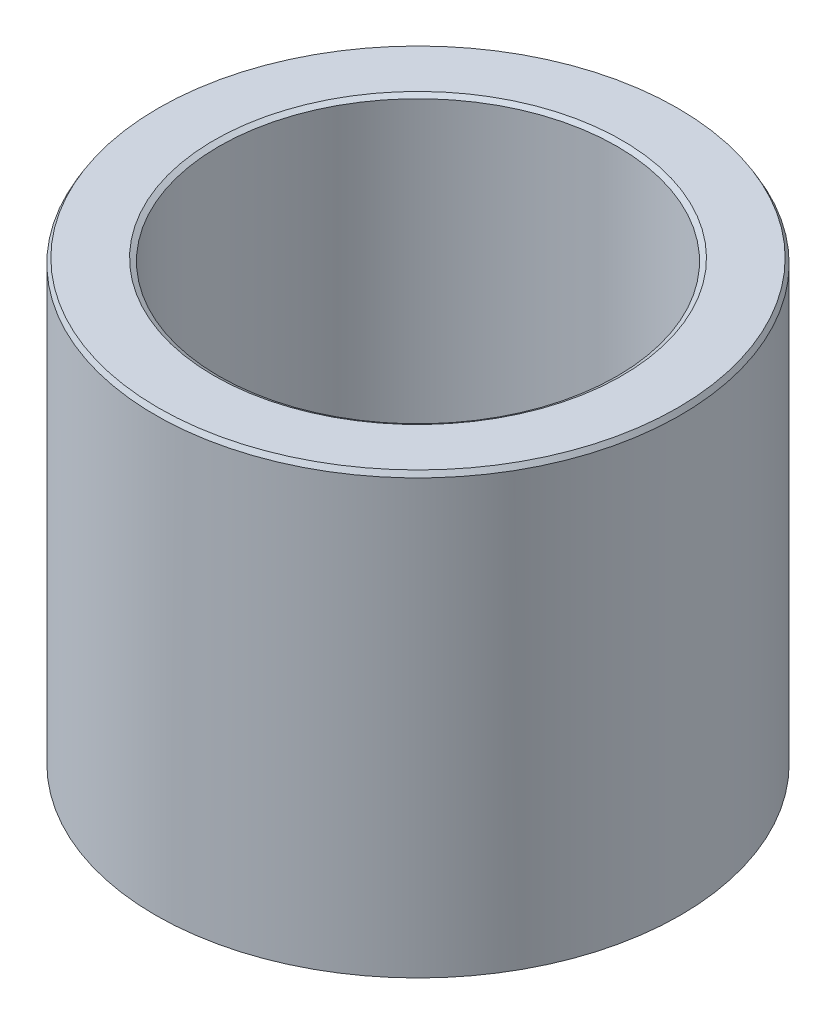
ISO-10303-21;
HEADER;
FILE_DESCRIPTION(('STEP AP214'),'2;1');
FILE_NAME('part.step','',(''),(''),'','','');
FILE_SCHEMA(('AUTOMOTIVE_DESIGN { 1 0 10303 214 1 1 1 1 }'));
ENDSEC;
DATA;
#1=APPLICATION_CONTEXT('core data for automotive mechanical design processes');
#2=APPLICATION_PROTOCOL_DEFINITION('international standard','automotive_design',2000,#1);
#3=PRODUCT_CONTEXT('',#1,'mechanical');
#4=PRODUCT('Part','Part','',(#3));
#5=PRODUCT_RELATED_PRODUCT_CATEGORY('part','',(#4));
#6=PRODUCT_DEFINITION_FORMATION('','',#4);
#7=PRODUCT_DEFINITION_CONTEXT('part definition',#1,'design');
#8=PRODUCT_DEFINITION('design','',#6,#7);
#9=PRODUCT_DEFINITION_SHAPE('','',#8);
#10=(LENGTH_UNIT() NAMED_UNIT(*) SI_UNIT(.MILLI.,.METRE.));
#11=(NAMED_UNIT(*) PLANE_ANGLE_UNIT() SI_UNIT($,.RADIAN.));
#12=(NAMED_UNIT(*) SI_UNIT($,.STERADIAN.) SOLID_ANGLE_UNIT());
#13=UNCERTAINTY_MEASURE_WITH_UNIT(LENGTH_MEASURE(1.E-05),#10,'distance_accuracy_value','');
#14=(GEOMETRIC_REPRESENTATION_CONTEXT(3) GLOBAL_UNCERTAINTY_ASSIGNED_CONTEXT((#13)) GLOBAL_UNIT_ASSIGNED_CONTEXT((#10,
#11,#12)) REPRESENTATION_CONTEXT('',''));
#15=CARTESIAN_POINT('',(0.,0.,0.));
#16=DIRECTION('',(0.,0.,1.));
#17=DIRECTION('',(1.,0.,0.));
#18=AXIS2_PLACEMENT_3D('',#15,#16,#17);
#19=CARTESIAN_POINT('',(0.,29.390861593314,0.));
#20=DIRECTION('',(0.,-1.,0.));
#21=DIRECTION('',(0.,0.,-1.));
#22=AXIS2_PLACEMENT_3D('',#19,#20,#21);
#23=CYLINDRICAL_SURFACE('',#22,17.5);
#24=CARTESIAN_POINT('',(0.,0.188964139140629,0.));
#25=DIRECTION('',(0.,1.,0.));
#26=DIRECTION('',(0.,0.,1.));
#27=AXIS2_PLACEMENT_3D('',#24,#25,#26);
#28=CIRCLE('',#27,17.5);
#29=CARTESIAN_POINT('',(0.,0.188964139140626,-17.5));
#30=VERTEX_POINT('',#29);
#31=EDGE_CURVE('E10',#30,#30,#28,.T.);
#32=CARTESIAN_POINT('',(0.,29.063566103514,0.));
#33=DIRECTION('',(0.,1.,0.));
#34=DIRECTION('',(0.,0.,1.));
#35=AXIS2_PLACEMENT_3D('',#32,#33,#34);
#36=CIRCLE('',#35,17.5);
#37=CARTESIAN_POINT('',(0.,29.063566103514,-17.5));
#38=VERTEX_POINT('',#37);
#39=EDGE_CURVE('E50',#38,#38,#36,.F.);
#40=CARTESIAN_POINT('',(0.,0.188964139140626,-17.5));
#41=CARTESIAN_POINT('',(0.,0.489741242936182,-17.5));
#42=CARTESIAN_POINT('',(0.,0.790518346731739,-17.5));
#43=CARTESIAN_POINT('',(0.,1.39207255432285,-17.5));
#44=CARTESIAN_POINT('',(0.,1.69284965811841,-17.5));
#45=CARTESIAN_POINT('',(0.,2.29440386570952,-17.5));
#46=CARTESIAN_POINT('',(0.,2.59518096950507,-17.5));
#47=CARTESIAN_POINT('',(0.,3.19673517709619,-17.5));
#48=CARTESIAN_POINT('',(0.,3.49751228089174,-17.5));
#49=CARTESIAN_POINT('',(0.,4.09906648848286,-17.5));
#50=CARTESIAN_POINT('',(0.,4.39984359227841,-17.5));
#51=CARTESIAN_POINT('',(0.,5.00139779986952,-17.5));
#52=CARTESIAN_POINT('',(0.,5.30217490366508,-17.5));
#53=CARTESIAN_POINT('',(0.,5.90372911125619,-17.5));
#54=CARTESIAN_POINT('',(0.,6.20450621505175,-17.5));
#55=CARTESIAN_POINT('',(0.,6.80606042264286,-17.5));
#56=CARTESIAN_POINT('',(0.,7.10683752643842,-17.5));
#57=CARTESIAN_POINT('',(0.,7.70839173402953,-17.5));
#58=CARTESIAN_POINT('',(0.,8.00916883782508,-17.5));
#59=CARTESIAN_POINT('',(0.,8.61072304541619,-17.5));
#60=CARTESIAN_POINT('',(0.,8.91150014921175,-17.5));
#61=CARTESIAN_POINT('',(0.,9.51305435680286,-17.5));
#62=CARTESIAN_POINT('',(0.,9.81383146059842,-17.5));
#63=CARTESIAN_POINT('',(0.,10.4153856681895,-17.5));
#64=CARTESIAN_POINT('',(0.,10.7161627719851,-17.5));
#65=CARTESIAN_POINT('',(0.,11.3177169795762,-17.5));
#66=CARTESIAN_POINT('',(0.,11.6184940833718,-17.5));
#67=CARTESIAN_POINT('',(0.,12.2200482909629,-17.5));
#68=CARTESIAN_POINT('',(0.,12.5208253947584,-17.5));
#69=CARTESIAN_POINT('',(0.,13.1223796023495,-17.5));
#70=CARTESIAN_POINT('',(0.,13.4231567061451,-17.5));
#71=CARTESIAN_POINT('',(0.,14.0247109137362,-17.5));
#72=CARTESIAN_POINT('',(0.,14.3254880175318,-17.5));
#73=CARTESIAN_POINT('',(0.,14.9270422251229,-17.5));
#74=CARTESIAN_POINT('',(0.,15.2278193289184,-17.5));
#75=CARTESIAN_POINT('',(0.,15.8293735365095,-17.5));
#76=CARTESIAN_POINT('',(0.,16.1301506403051,-17.5));
#77=CARTESIAN_POINT('',(0.,16.7317048478962,-17.5));
#78=CARTESIAN_POINT('',(0.,17.0324819516918,-17.5));
#79=CARTESIAN_POINT('',(0.,17.6340361592829,-17.5));
#80=CARTESIAN_POINT('',(0.,17.9348132630784,-17.5));
#81=CARTESIAN_POINT('',(0.,18.5363674706695,-17.5));
#82=CARTESIAN_POINT('',(0.,18.8371445744651,-17.5));
#83=CARTESIAN_POINT('',(0.,19.4386987820562,-17.5));
#84=CARTESIAN_POINT('',(0.,19.7394758858518,-17.5));
#85=CARTESIAN_POINT('',(0.,20.3410300934429,-17.5));
#86=CARTESIAN_POINT('',(0.,20.6418071972384,-17.5));
#87=CARTESIAN_POINT('',(0.,21.2433614048295,-17.5));
#88=CARTESIAN_POINT('',(0.,21.5441385086251,-17.5));
#89=CARTESIAN_POINT('',(0.,22.1456927162162,-17.5));
#90=CARTESIAN_POINT('',(0.,22.4464698200118,-17.5));
#91=CARTESIAN_POINT('',(0.,23.0480240276029,-17.5));
#92=CARTESIAN_POINT('',(0.,23.3488011313984,-17.5));
#93=CARTESIAN_POINT('',(0.,23.9503553389896,-17.5));
#94=CARTESIAN_POINT('',(0.,24.2511324427851,-17.5));
#95=CARTESIAN_POINT('',(0.,24.8526866503762,-17.5));
#96=CARTESIAN_POINT('',(0.,25.1534637541718,-17.5));
#97=CARTESIAN_POINT('',(0.,25.7550179617629,-17.5));
#98=CARTESIAN_POINT('',(0.,26.0557950655584,-17.5));
#99=CARTESIAN_POINT('',(0.,26.6573492731496,-17.5));
#100=CARTESIAN_POINT('',(0.,26.9581263769451,-17.5));
#101=CARTESIAN_POINT('',(0.,27.5596805845362,-17.5));
#102=CARTESIAN_POINT('',(0.,27.8604576883318,-17.5));
#103=CARTESIAN_POINT('',(0.,28.4620118959229,-17.5));
#104=CARTESIAN_POINT('',(0.,28.7627889997184,-17.5));
#105=CARTESIAN_POINT('',(0.,29.063566103514,-17.5));
#106=B_SPLINE_CURVE_WITH_KNOTS('',3,(#40,#41,#42,#43,#44,#45,#46,#47,#48,#49,#50,#51,#52,#53,
#54,#55,#56,#57,#58,#59,#60,#61,#62,#63,#64,#65,#66,#67,#68,#69,#70,#71,#72,#73,#74,#75,#76,#77,
#78,#79,#80,#81,#82,#83,#84,#85,#86,#87,#88,#89,#90,#91,#92,#93,#94,#95,#96,#97,#98,#99,#100,
#101,#102,#103,#104,#105),.UNSPECIFIED.,.F.,.F.,(4,2,2,2,2,2,2,2,2,2,2,2,2,2,2,2,2,2,2,2,2,2,2,
2,2,2,2,2,2,2,2,2,4),(0.,0.902331311386669,1.80466262277333,2.70699393416,3.60932524554667,
4.51165655693334,5.41398786832001,6.31631917970668,7.21865049109335,8.12098180248001,
9.02331311386668,9.92564442525335,10.82797573664,11.7303070480267,12.6326383594134,
13.5349696708,14.4373009821867,15.3396322935734,16.24196360496,17.1442949163467,
18.0466262277334,18.94895753912,19.8512888505067,20.7536201618934,21.65595147328,
22.5582827846667,23.4606140960534,24.36294540744,25.2652767188267,26.1676080302134,
27.0699393416,27.9722706529867,28.8746019643734),.UNSPECIFIED.);
#107=EDGE_CURVE('BSEAM39',#30,#38,#106,.T.);
#108=ORIENTED_EDGE('',*,*,#31,.T.);
#109=ORIENTED_EDGE('',*,*,#39,.T.);
#110=ORIENTED_EDGE('',*,*,#107,.T.);
#111=ORIENTED_EDGE('',*,*,#107,.F.);
#112=EDGE_LOOP('',(#108,#110,#109,#111));
#113=FACE_BOUND('',#112,.T.);
#114=ADVANCED_FACE('F39',(#113),#23,.T.);
#115=CARTESIAN_POINT('',(0.,29.390861593314,0.));
#116=DIRECTION('',(0.,1.,0.));
#117=DIRECTION('',(0.,0.,1.));
#118=AXIS2_PLACEMENT_3D('',#115,#116,#117);
#119=PLANE('',#118);
#120=CARTESIAN_POINT('',(0.,29.390861593314,0.));
#121=DIRECTION('',(0.,1.,0.));
#122=DIRECTION('',(0.,0.,1.));
#123=AXIS2_PLACEMENT_3D('',#120,#121,#122);
#124=CIRCLE('',#123,13.6010412750918);
#125=CARTESIAN_POINT('',(0.,29.390861593314,13.6010412750918));
#126=VERTEX_POINT('',#125);
#127=EDGE_CURVE('E58',#126,#126,#124,.F.);
#128=ORIENTED_EDGE('',*,*,#127,.T.);
#129=EDGE_LOOP('',(#128));
#130=FACE_BOUND('',#129,.T.);
#131=CARTESIAN_POINT('',(0.,29.390861593314,0.));
#132=DIRECTION('',(0.,1.,0.));
#133=DIRECTION('',(0.,0.,1.));
#134=AXIS2_PLACEMENT_3D('',#131,#132,#133);
#135=CIRCLE('',#134,17.3110358608594);
#136=CARTESIAN_POINT('',(0.,29.390861593314,17.3110358608594));
#137=VERTEX_POINT('',#136);
#138=EDGE_CURVE('E61',#137,#137,#135,.T.);
#139=ORIENTED_EDGE('',*,*,#138,.T.);
#140=EDGE_LOOP('',(#139));
#141=FACE_BOUND('',#140,.T.);
#142=ADVANCED_FACE('F88',(#130,#141),#119,.T.);
#143=CARTESIAN_POINT('',(0.,0.,0.));
#144=DIRECTION('',(0.,1.,0.));
#145=DIRECTION('',(0.,0.,1.));
#146=AXIS2_PLACEMENT_3D('',#143,#144,#145);
#147=PLANE('',#146);
#148=CARTESIAN_POINT('',(0.,0.,0.));
#149=DIRECTION('',(0.,1.,0.));
#150=DIRECTION('',(0.,0.,1.));
#151=AXIS2_PLACEMENT_3D('',#148,#149,#150);
#152=CIRCLE('',#151,13.4627099244323);
#153=CARTESIAN_POINT('',(0.,0.,13.4627099244323));
#154=VERTEX_POINT('',#153);
#155=EDGE_CURVE('E51',#154,#154,#152,.T.);
#156=ORIENTED_EDGE('',*,*,#155,.T.);
#157=EDGE_LOOP('',(#156));
#158=FACE_BOUND('',#157,.T.);
#159=CARTESIAN_POINT('',(0.,0.,0.));
#160=DIRECTION('',(0.,1.,0.));
#161=DIRECTION('',(0.,0.,1.));
#162=AXIS2_PLACEMENT_3D('',#159,#160,#161);
#163=CIRCLE('',#162,17.1727045101999);
#164=CARTESIAN_POINT('',(0.,0.,17.1727045101999));
#165=VERTEX_POINT('',#164);
#166=EDGE_CURVE('E54',#165,#165,#163,.F.);
#167=ORIENTED_EDGE('',*,*,#166,.T.);
#168=EDGE_LOOP('',(#167));
#169=FACE_BOUND('',#168,.T.);
#170=ADVANCED_FACE('F83',(#158,#169),#147,.F.);
#171=CARTESIAN_POINT('',(0.,29.390861593314,0.));
#172=DIRECTION('',(0.,-1.,0.));
#173=DIRECTION('',(0.,0.,-1.));
#174=AXIS2_PLACEMENT_3D('',#171,#172,#173);
#175=CYLINDRICAL_SURFACE('',#174,13.2737457852917);
#176=CARTESIAN_POINT('',(0.,29.2018974541734,0.));
#177=DIRECTION('',(0.,1.,0.));
#178=DIRECTION('',(0.,0.,1.));
#179=AXIS2_PLACEMENT_3D('',#176,#177,#178);
#180=CIRCLE('',#179,13.2737457852917);
#181=CARTESIAN_POINT('',(0.,29.2018974541734,-13.2737457852917));
#182=VERTEX_POINT('',#181);
#183=EDGE_CURVE('E67',#182,#182,#180,.T.);
#184=CARTESIAN_POINT('',(0.,0.327295489800046,0.));
#185=DIRECTION('',(0.,1.,0.));
#186=DIRECTION('',(0.,0.,1.));
#187=AXIS2_PLACEMENT_3D('',#184,#185,#186);
#188=CIRCLE('',#187,13.2737457852917);
#189=CARTESIAN_POINT('',(0.,0.327295489800043,-13.2737457852917));
#190=VERTEX_POINT('',#189);
#191=EDGE_CURVE('E69',#190,#190,#188,.F.);
#192=CARTESIAN_POINT('',(0.,29.2018974541734,-13.2737457852917));
#193=CARTESIAN_POINT('',(0.,28.9011203503778,-13.2737457852917));
#194=CARTESIAN_POINT('',(0.,28.6003432465823,-13.2737457852917));
#195=CARTESIAN_POINT('',(0.,27.9987890389911,-13.2737457852917));
#196=CARTESIAN_POINT('',(0.,27.6980119351956,-13.2737457852917));
#197=CARTESIAN_POINT('',(0.,27.0964577276045,-13.2737457852917));
#198=CARTESIAN_POINT('',(0.,26.7956806238089,-13.2737457852917));
#199=CARTESIAN_POINT('',(0.,26.1941264162178,-13.2737457852917));
#200=CARTESIAN_POINT('',(0.,25.8933493124223,-13.2737457852917));
#201=CARTESIAN_POINT('',(0.,25.2917951048312,-13.2737457852917));
#202=CARTESIAN_POINT('',(0.,24.9910180010356,-13.2737457852917));
#203=CARTESIAN_POINT('',(0.,24.3894637934445,-13.2737457852917));
#204=CARTESIAN_POINT('',(0.,24.0886866896489,-13.2737457852917));
#205=CARTESIAN_POINT('',(0.,23.4871324820578,-13.2737457852917));
#206=CARTESIAN_POINT('',(0.,23.1863553782623,-13.2737457852917));
#207=CARTESIAN_POINT('',(0.,22.5848011706712,-13.2737457852917));
#208=CARTESIAN_POINT('',(0.,22.2840240668756,-13.2737457852917));
#209=CARTESIAN_POINT('',(0.,21.6824698592845,-13.2737457852917));
#210=CARTESIAN_POINT('',(0.,21.3816927554889,-13.2737457852917));
#211=CARTESIAN_POINT('',(0.,20.7801385478978,-13.2737457852917));
#212=CARTESIAN_POINT('',(0.,20.4793614441023,-13.2737457852917));
#213=CARTESIAN_POINT('',(0.,19.8778072365112,-13.2737457852917));
#214=CARTESIAN_POINT('',(0.,19.5770301327156,-13.2737457852917));
#215=CARTESIAN_POINT('',(0.,18.9754759251245,-13.2737457852917));
#216=CARTESIAN_POINT('',(0.,18.6746988213289,-13.2737457852917));
#217=CARTESIAN_POINT('',(0.,18.0731446137378,-13.2737457852917));
#218=CARTESIAN_POINT('',(0.,17.7723675099423,-13.2737457852917));
#219=CARTESIAN_POINT('',(0.,17.1708133023512,-13.2737457852917));
#220=CARTESIAN_POINT('',(0.,16.8700361985556,-13.2737457852917));
#221=CARTESIAN_POINT('',(0.,16.2684819909645,-13.2737457852917));
#222=CARTESIAN_POINT('',(0.,15.9677048871689,-13.2737457852917));
#223=CARTESIAN_POINT('',(0.,15.3661506795778,-13.2737457852917));
#224=CARTESIAN_POINT('',(0.,15.0653735757823,-13.2737457852917));
#225=CARTESIAN_POINT('',(0.,14.4638193681912,-13.2737457852917));
#226=CARTESIAN_POINT('',(0.,14.1630422643956,-13.2737457852917));
#227=CARTESIAN_POINT('',(0.,13.5614880568045,-13.2737457852917));
#228=CARTESIAN_POINT('',(0.,13.2607109530089,-13.2737457852917));
#229=CARTESIAN_POINT('',(0.,12.6591567454178,-13.2737457852917));
#230=CARTESIAN_POINT('',(0.,12.3583796416223,-13.2737457852917));
#231=CARTESIAN_POINT('',(0.,11.7568254340312,-13.2737457852917));
#232=CARTESIAN_POINT('',(0.,11.4560483302356,-13.2737457852917));
#233=CARTESIAN_POINT('',(0.,10.8544941226445,-13.2737457852917));
#234=CARTESIAN_POINT('',(0.,10.5537170188489,-13.2737457852917));
#235=CARTESIAN_POINT('',(0.,9.95216281125782,-13.2737457852917));
#236=CARTESIAN_POINT('',(0.,9.65138570746226,-13.2737457852917));
#237=CARTESIAN_POINT('',(0.,9.04983149987115,-13.2737457852917));
#238=CARTESIAN_POINT('',(0.,8.7490543960756,-13.2737457852917));
#239=CARTESIAN_POINT('',(0.,8.14750018848449,-13.2737457852917));
#240=CARTESIAN_POINT('',(0.,7.84672308468893,-13.2737457852917));
#241=CARTESIAN_POINT('',(0.,7.24516887709782,-13.2737457852917));
#242=CARTESIAN_POINT('',(0.,6.94439177330226,-13.2737457852917));
#243=CARTESIAN_POINT('',(0.,6.34283756571115,-13.2737457852917));
#244=CARTESIAN_POINT('',(0.,6.0420604619156,-13.2737457852917));
#245=CARTESIAN_POINT('',(0.,5.44050625432449,-13.2737457852917));
#246=CARTESIAN_POINT('',(0.,5.13972915052893,-13.2737457852917));
#247=CARTESIAN_POINT('',(0.,4.53817494293782,-13.2737457852917));
#248=CARTESIAN_POINT('',(0.,4.23739783914227,-13.2737457852917));
#249=CARTESIAN_POINT('',(0.,3.63584363155116,-13.2737457852917));
#250=CARTESIAN_POINT('',(0.,3.3350665277556,-13.2737457852917));
#251=CARTESIAN_POINT('',(0.,2.73351232016449,-13.2737457852917));
#252=CARTESIAN_POINT('',(0.,2.43273521636893,-13.2737457852917));
#253=CARTESIAN_POINT('',(0.,1.83118100877782,-13.2737457852917));
#254=CARTESIAN_POINT('',(0.,1.53040390498226,-13.2737457852917));
#255=CARTESIAN_POINT('',(0.,0.928849697391153,-13.2737457852917));
#256=CARTESIAN_POINT('',(0.,0.628072593595598,-13.2737457852917));
#257=CARTESIAN_POINT('',(0.,0.327295489800043,-13.2737457852917));
#258=B_SPLINE_CURVE_WITH_KNOTS('',3,(#192,#193,#194,#195,#196,#197,#198,#199,#200,#201,#202,
#203,#204,#205,#206,#207,#208,#209,#210,#211,#212,#213,#214,#215,#216,#217,#218,#219,#220,#221,
#222,#223,#224,#225,#226,#227,#228,#229,#230,#231,#232,#233,#234,#235,#236,#237,#238,#239,#240,
#241,#242,#243,#244,#245,#246,#247,#248,#249,#250,#251,#252,#253,#254,#255,#256,#257),
.UNSPECIFIED.,.F.,.F.,(4,2,2,2,2,2,2,2,2,2,2,2,2,2,2,2,2,2,2,2,2,2,2,2,2,2,2,2,2,2,2,2,4),(0.,
0.902331311386669,1.80466262277333,2.70699393416,3.60932524554667,4.51165655693333,
5.41398786832,6.31631917970667,7.21865049109333,8.12098180248,9.02331311386667,9.92564442525333,
10.82797573664,11.7303070480267,12.6326383594133,13.5349696708,14.4373009821867,
15.3396322935733,16.24196360496,17.1442949163467,18.0466262277333,18.94895753912,
19.8512888505067,20.7536201618933,21.65595147328,22.5582827846667,23.4606140960533,
24.36294540744,25.2652767188267,26.1676080302133,27.0699393416,27.9722706529867,
28.8746019643733),.UNSPECIFIED.);
#259=EDGE_CURVE('BSEAM71',#182,#190,#258,.T.);
#260=ORIENTED_EDGE('',*,*,#183,.T.);
#261=ORIENTED_EDGE('',*,*,#191,.T.);
#262=ORIENTED_EDGE('',*,*,#259,.T.);
#263=ORIENTED_EDGE('',*,*,#259,.F.);
#264=EDGE_LOOP('',(#260,#262,#261,#263));
#265=FACE_BOUND('',#264,.T.);
#266=ADVANCED_FACE('F71',(#265),#175,.F.);
#267=CARTESIAN_POINT('',(0.,29.2018974541734,0.));
#268=DIRECTION('',(0.,1.,0.));
#269=DIRECTION('',(0.,0.,1.));
#270=AXIS2_PLACEMENT_3D('',#267,#268,#269);
#271=CONICAL_SURFACE('',#270,13.2737457852917,1.0471975511966);
#272=ORIENTED_EDGE('',*,*,#127,.F.);
#273=EDGE_LOOP('',(#272));
#274=FACE_BOUND('',#273,.T.);
#275=ORIENTED_EDGE('',*,*,#183,.F.);
#276=EDGE_LOOP('',(#275));
#277=FACE_BOUND('',#276,.T.);
#278=ADVANCED_FACE('F77',(#274,#277),#271,.F.);
#279=CARTESIAN_POINT('',(0.,0.,0.));
#280=DIRECTION('',(0.,-1.,0.));
#281=DIRECTION('',(0.,0.,-1.));
#282=AXIS2_PLACEMENT_3D('',#279,#280,#281);
#283=CONICAL_SURFACE('',#282,13.4627099244323,0.523598775598291);
#284=ORIENTED_EDGE('',*,*,#191,.F.);
#285=EDGE_LOOP('',(#284));
#286=FACE_BOUND('',#285,.T.);
#287=ORIENTED_EDGE('',*,*,#155,.F.);
#288=EDGE_LOOP('',(#287));
#289=FACE_BOUND('',#288,.T.);
#290=ADVANCED_FACE('F73',(#286,#289),#283,.F.);
#291=CARTESIAN_POINT('',(0.,0.188964139140629,0.));
#292=DIRECTION('',(0.,1.,0.));
#293=DIRECTION('',(0.,0.,1.));
#294=AXIS2_PLACEMENT_3D('',#291,#292,#293);
#295=CONICAL_SURFACE('',#294,17.5,1.04719755119659);
#296=ORIENTED_EDGE('',*,*,#166,.F.);
#297=EDGE_LOOP('',(#296));
#298=FACE_BOUND('',#297,.T.);
#299=ORIENTED_EDGE('',*,*,#31,.F.);
#300=EDGE_LOOP('',(#299));
#301=FACE_BOUND('',#300,.T.);
#302=ADVANCED_FACE('F76',(#298,#301),#295,.T.);
#303=CARTESIAN_POINT('',(0.,29.390861593314,0.));
#304=DIRECTION('',(0.,-1.,0.));
#305=DIRECTION('',(0.,0.,-1.));
#306=AXIS2_PLACEMENT_3D('',#303,#304,#305);
#307=CONICAL_SURFACE('',#306,17.3110358608594,0.523598775598291);
#308=ORIENTED_EDGE('',*,*,#39,.F.);
#309=EDGE_LOOP('',(#308));
#310=FACE_BOUND('',#309,.T.);
#311=ORIENTED_EDGE('',*,*,#138,.F.);
#312=EDGE_LOOP('',(#311));
#313=FACE_BOUND('',#312,.T.);
#314=ADVANCED_FACE('F45',(#310,#313),#307,.T.);
#315=CLOSED_SHELL('',(#114,#142,#170,#266,#278,#290,#302,#314));
#316=MANIFOLD_SOLID_BREP('B2',#315);
#317=ADVANCED_BREP_SHAPE_REPRESENTATION('',(#18,#316),#14);
#318=SHAPE_DEFINITION_REPRESENTATION(#9,#317);
ENDSEC;
END-ISO-10303-21;
